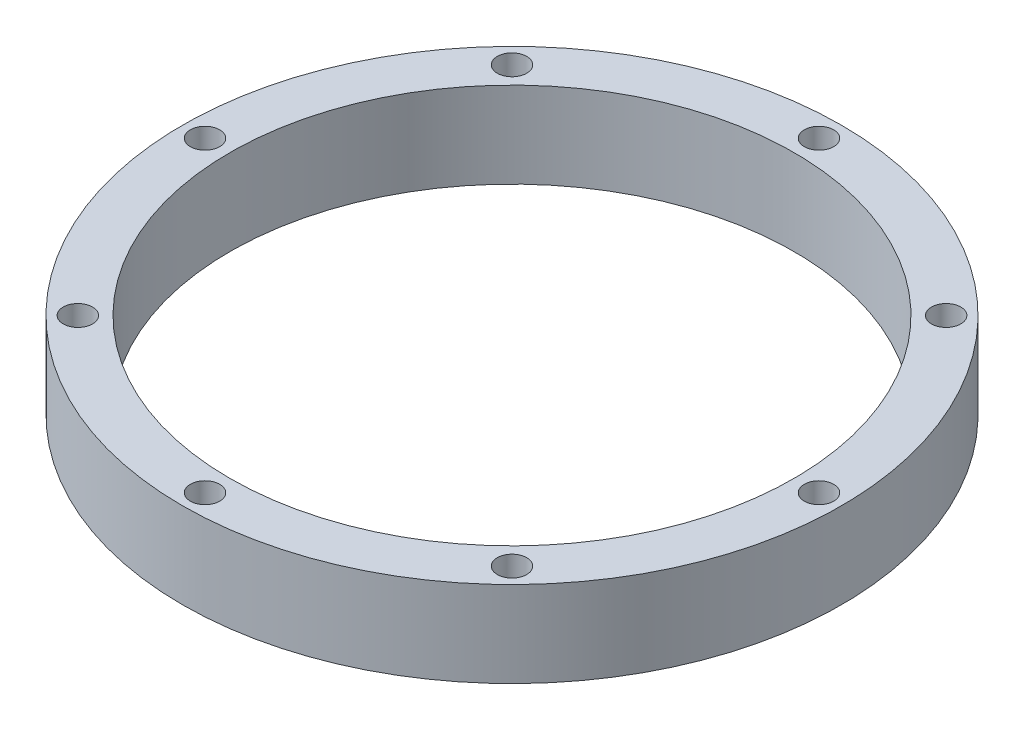
ISO-10303-21;
HEADER;
FILE_DESCRIPTION(('STEP AP214'),'2;1');
FILE_NAME('part.step','',(''),(''),'','','');
FILE_SCHEMA(('AUTOMOTIVE_DESIGN { 1 0 10303 214 1 1 1 1 }'));
ENDSEC;
DATA;
#1=APPLICATION_CONTEXT('core data for automotive mechanical design processes');
#2=APPLICATION_PROTOCOL_DEFINITION('international standard','automotive_design',2000,#1);
#3=PRODUCT_CONTEXT('',#1,'mechanical');
#4=PRODUCT('Part','Part','',(#3));
#5=PRODUCT_RELATED_PRODUCT_CATEGORY('part','',(#4));
#6=PRODUCT_DEFINITION_FORMATION('','',#4);
#7=PRODUCT_DEFINITION_CONTEXT('part definition',#1,'design');
#8=PRODUCT_DEFINITION('design','',#6,#7);
#9=PRODUCT_DEFINITION_SHAPE('','',#8);
#10=(LENGTH_UNIT() NAMED_UNIT(*) SI_UNIT(.MILLI.,.METRE.));
#11=(NAMED_UNIT(*) PLANE_ANGLE_UNIT() SI_UNIT($,.RADIAN.));
#12=(NAMED_UNIT(*) SI_UNIT($,.STERADIAN.) SOLID_ANGLE_UNIT());
#13=UNCERTAINTY_MEASURE_WITH_UNIT(LENGTH_MEASURE(1.E-05),#10,'distance_accuracy_value','');
#14=(GEOMETRIC_REPRESENTATION_CONTEXT(3) GLOBAL_UNCERTAINTY_ASSIGNED_CONTEXT((#13)) GLOBAL_UNIT_ASSIGNED_CONTEXT((#10,
#11,#12)) REPRESENTATION_CONTEXT('',''));
#15=CARTESIAN_POINT('',(0.,0.,0.));
#16=DIRECTION('',(0.,0.,1.));
#17=DIRECTION('',(1.,0.,0.));
#18=AXIS2_PLACEMENT_3D('',#15,#16,#17);
#19=CARTESIAN_POINT('',(0.,19.,0.));
#20=DIRECTION('',(0.,1.,0.));
#21=DIRECTION('',(0.,0.,1.));
#22=AXIS2_PLACEMENT_3D('',#19,#20,#21);
#23=PLANE('',#22);
#24=CARTESIAN_POINT('',(0.,19.,68.));
#25=DIRECTION('',(0.,1.,0.));
#26=DIRECTION('',(0.,0.,1.));
#27=AXIS2_PLACEMENT_3D('',#24,#25,#26);
#28=CIRCLE('',#27,3.25);
#29=CARTESIAN_POINT('',(0.,19.,71.25));
#30=VERTEX_POINT('',#29);
#31=EDGE_CURVE('E83',#30,#30,#28,.T.);
#32=ORIENTED_EDGE('',*,*,#31,.F.);
#33=EDGE_LOOP('',(#32));
#34=FACE_BOUND('',#33,.T.);
#35=CARTESIAN_POINT('',(68.,19.,0.));
#36=DIRECTION('',(0.,1.,0.));
#37=DIRECTION('',(0.,0.,1.));
#38=AXIS2_PLACEMENT_3D('',#35,#36,#37);
#39=CIRCLE('',#38,3.25000000000001);
#40=CARTESIAN_POINT('',(68.,19.,3.25));
#41=VERTEX_POINT('',#40);
#42=EDGE_CURVE('E71',#41,#41,#39,.T.);
#43=ORIENTED_EDGE('',*,*,#42,.F.);
#44=EDGE_LOOP('',(#43));
#45=FACE_BOUND('',#44,.T.);
#46=CARTESIAN_POINT('',(0.,19.,-68.));
#47=DIRECTION('',(0.,1.,0.));
#48=DIRECTION('',(0.,0.,1.));
#49=AXIS2_PLACEMENT_3D('',#46,#47,#48);
#50=CIRCLE('',#49,3.25);
#51=CARTESIAN_POINT('',(0.,19.,-64.75));
#52=VERTEX_POINT('',#51);
#53=EDGE_CURVE('E59',#52,#52,#50,.T.);
#54=ORIENTED_EDGE('',*,*,#53,.F.);
#55=EDGE_LOOP('',(#54));
#56=FACE_BOUND('',#55,.T.);
#57=CARTESIAN_POINT('',(-68.,19.,0.));
#58=DIRECTION('',(0.,1.,0.));
#59=DIRECTION('',(0.,0.,1.));
#60=AXIS2_PLACEMENT_3D('',#57,#58,#59);
#61=CIRCLE('',#60,3.25000000000001);
#62=CARTESIAN_POINT('',(-68.,19.,3.25000000000001));
#63=VERTEX_POINT('',#62);
#64=EDGE_CURVE('E47',#63,#63,#61,.T.);
#65=ORIENTED_EDGE('',*,*,#64,.F.);
#66=EDGE_LOOP('',(#65));
#67=FACE_BOUND('',#66,.T.);
#68=CARTESIAN_POINT('',(0.,19.,0.));
#69=DIRECTION('',(0.,1.,0.));
#70=DIRECTION('',(0.,0.,1.));
#71=AXIS2_PLACEMENT_3D('',#68,#69,#70);
#72=CIRCLE('',#71,73.);
#73=CARTESIAN_POINT('',(0.,19.,73.));
#74=VERTEX_POINT('',#73);
#75=EDGE_CURVE('E10',#74,#74,#72,.T.);
#76=ORIENTED_EDGE('',*,*,#75,.T.);
#77=EDGE_LOOP('',(#76));
#78=FACE_BOUND('',#77,.T.);
#79=CARTESIAN_POINT('',(0.,19.,0.));
#80=DIRECTION('',(0.,1.,0.));
#81=DIRECTION('',(0.,0.,1.));
#82=AXIS2_PLACEMENT_3D('',#79,#80,#81);
#83=CIRCLE('',#82,62.5);
#84=CARTESIAN_POINT('',(0.,19.,62.5));
#85=VERTEX_POINT('',#84);
#86=EDGE_CURVE('E42',#85,#85,#83,.T.);
#87=ORIENTED_EDGE('',*,*,#86,.F.);
#88=EDGE_LOOP('',(#87));
#89=FACE_BOUND('',#88,.T.);
#90=CARTESIAN_POINT('',(-48.0832611206852,19.,-48.0832611206852));
#91=DIRECTION('',(0.,1.,0.));
#92=DIRECTION('',(0.,0.,1.));
#93=AXIS2_PLACEMENT_3D('',#90,#91,#92);
#94=CIRCLE('',#93,3.25);
#95=CARTESIAN_POINT('',(-48.0832611206852,19.,-44.8332611206852));
#96=VERTEX_POINT('',#95);
#97=EDGE_CURVE('E53',#96,#96,#94,.T.);
#98=ORIENTED_EDGE('',*,*,#97,.F.);
#99=EDGE_LOOP('',(#98));
#100=FACE_BOUND('',#99,.T.);
#101=CARTESIAN_POINT('',(48.0832611206852,19.,-48.0832611206852));
#102=DIRECTION('',(0.,1.,0.));
#103=DIRECTION('',(0.,0.,1.));
#104=AXIS2_PLACEMENT_3D('',#101,#102,#103);
#105=CIRCLE('',#104,3.25);
#106=CARTESIAN_POINT('',(48.0832611206852,19.,-44.8332611206852));
#107=VERTEX_POINT('',#106);
#108=EDGE_CURVE('E65',#107,#107,#105,.T.);
#109=ORIENTED_EDGE('',*,*,#108,.F.);
#110=EDGE_LOOP('',(#109));
#111=FACE_BOUND('',#110,.T.);
#112=CARTESIAN_POINT('',(48.0832611206853,19.,48.0832611206852));
#113=DIRECTION('',(0.,1.,0.));
#114=DIRECTION('',(0.,0.,1.));
#115=AXIS2_PLACEMENT_3D('',#112,#113,#114);
#116=CIRCLE('',#115,3.25);
#117=CARTESIAN_POINT('',(48.0832611206853,19.,51.3332611206852));
#118=VERTEX_POINT('',#117);
#119=EDGE_CURVE('E77',#118,#118,#116,.T.);
#120=ORIENTED_EDGE('',*,*,#119,.F.);
#121=EDGE_LOOP('',(#120));
#122=FACE_BOUND('',#121,.T.);
#123=CARTESIAN_POINT('',(-48.0832611206852,19.,48.0832611206853));
#124=DIRECTION('',(0.,1.,0.));
#125=DIRECTION('',(0.,0.,1.));
#126=AXIS2_PLACEMENT_3D('',#123,#124,#125);
#127=CIRCLE('',#126,3.25);
#128=CARTESIAN_POINT('',(-48.0832611206852,19.,51.3332611206853));
#129=VERTEX_POINT('',#128);
#130=EDGE_CURVE('E89',#129,#129,#127,.T.);
#131=ORIENTED_EDGE('',*,*,#130,.F.);
#132=EDGE_LOOP('',(#131));
#133=FACE_BOUND('',#132,.T.);
#134=ADVANCED_FACE('F31',(#34,#45,#56,#67,#78,#89,#100,#111,#122,#133),#23,.T.);
#135=CARTESIAN_POINT('',(0.,0.,0.));
#136=DIRECTION('',(0.,1.,0.));
#137=DIRECTION('',(0.,0.,1.));
#138=AXIS2_PLACEMENT_3D('',#135,#136,#137);
#139=PLANE('',#138);
#140=CARTESIAN_POINT('',(0.,0.,68.));
#141=DIRECTION('',(0.,1.,0.));
#142=DIRECTION('',(0.,0.,1.));
#143=AXIS2_PLACEMENT_3D('',#140,#141,#142);
#144=CIRCLE('',#143,3.25);
#145=CARTESIAN_POINT('',(0.,0.,71.25));
#146=VERTEX_POINT('',#145);
#147=EDGE_CURVE('E86',#146,#146,#144,.T.);
#148=ORIENTED_EDGE('',*,*,#147,.T.);
#149=EDGE_LOOP('',(#148));
#150=FACE_BOUND('',#149,.T.);
#151=CARTESIAN_POINT('',(68.,0.,0.));
#152=DIRECTION('',(0.,1.,0.));
#153=DIRECTION('',(0.,0.,1.));
#154=AXIS2_PLACEMENT_3D('',#151,#152,#153);
#155=CIRCLE('',#154,3.25000000000001);
#156=CARTESIAN_POINT('',(68.,0.,3.25));
#157=VERTEX_POINT('',#156);
#158=EDGE_CURVE('E74',#157,#157,#155,.T.);
#159=ORIENTED_EDGE('',*,*,#158,.T.);
#160=EDGE_LOOP('',(#159));
#161=FACE_BOUND('',#160,.T.);
#162=CARTESIAN_POINT('',(0.,0.,-68.));
#163=DIRECTION('',(0.,1.,0.));
#164=DIRECTION('',(0.,0.,1.));
#165=AXIS2_PLACEMENT_3D('',#162,#163,#164);
#166=CIRCLE('',#165,3.25);
#167=CARTESIAN_POINT('',(0.,0.,-64.75));
#168=VERTEX_POINT('',#167);
#169=EDGE_CURVE('E62',#168,#168,#166,.T.);
#170=ORIENTED_EDGE('',*,*,#169,.T.);
#171=EDGE_LOOP('',(#170));
#172=FACE_BOUND('',#171,.T.);
#173=CARTESIAN_POINT('',(-68.,0.,0.));
#174=DIRECTION('',(0.,1.,0.));
#175=DIRECTION('',(0.,0.,1.));
#176=AXIS2_PLACEMENT_3D('',#173,#174,#175);
#177=CIRCLE('',#176,3.25000000000001);
#178=CARTESIAN_POINT('',(-68.,0.,3.25000000000001));
#179=VERTEX_POINT('',#178);
#180=EDGE_CURVE('E50',#179,#179,#177,.T.);
#181=ORIENTED_EDGE('',*,*,#180,.T.);
#182=EDGE_LOOP('',(#181));
#183=FACE_BOUND('',#182,.T.);
#184=CARTESIAN_POINT('',(0.,0.,0.));
#185=DIRECTION('',(0.,1.,0.));
#186=DIRECTION('',(0.,0.,1.));
#187=AXIS2_PLACEMENT_3D('',#184,#185,#186);
#188=CIRCLE('',#187,73.);
#189=CARTESIAN_POINT('',(0.,0.,73.));
#190=VERTEX_POINT('',#189);
#191=EDGE_CURVE('E35',#190,#190,#188,.T.);
#192=ORIENTED_EDGE('',*,*,#191,.F.);
#193=EDGE_LOOP('',(#192));
#194=FACE_BOUND('',#193,.T.);
#195=CARTESIAN_POINT('',(0.,0.,0.));
#196=DIRECTION('',(0.,1.,0.));
#197=DIRECTION('',(0.,0.,1.));
#198=AXIS2_PLACEMENT_3D('',#195,#196,#197);
#199=CIRCLE('',#198,62.5);
#200=CARTESIAN_POINT('',(0.,0.,62.5));
#201=VERTEX_POINT('',#200);
#202=EDGE_CURVE('E44',#201,#201,#199,.T.);
#203=ORIENTED_EDGE('',*,*,#202,.T.);
#204=EDGE_LOOP('',(#203));
#205=FACE_BOUND('',#204,.T.);
#206=CARTESIAN_POINT('',(-48.0832611206852,0.,-48.0832611206852));
#207=DIRECTION('',(0.,1.,0.));
#208=DIRECTION('',(0.,0.,1.));
#209=AXIS2_PLACEMENT_3D('',#206,#207,#208);
#210=CIRCLE('',#209,3.25);
#211=CARTESIAN_POINT('',(-48.0832611206852,0.,-44.8332611206852));
#212=VERTEX_POINT('',#211);
#213=EDGE_CURVE('E56',#212,#212,#210,.T.);
#214=ORIENTED_EDGE('',*,*,#213,.T.);
#215=EDGE_LOOP('',(#214));
#216=FACE_BOUND('',#215,.T.);
#217=CARTESIAN_POINT('',(48.0832611206852,0.,-48.0832611206852));
#218=DIRECTION('',(0.,1.,0.));
#219=DIRECTION('',(0.,0.,1.));
#220=AXIS2_PLACEMENT_3D('',#217,#218,#219);
#221=CIRCLE('',#220,3.25);
#222=CARTESIAN_POINT('',(48.0832611206852,0.,-44.8332611206852));
#223=VERTEX_POINT('',#222);
#224=EDGE_CURVE('E68',#223,#223,#221,.T.);
#225=ORIENTED_EDGE('',*,*,#224,.T.);
#226=EDGE_LOOP('',(#225));
#227=FACE_BOUND('',#226,.T.);
#228=CARTESIAN_POINT('',(48.0832611206853,0.,48.0832611206852));
#229=DIRECTION('',(0.,1.,0.));
#230=DIRECTION('',(0.,0.,1.));
#231=AXIS2_PLACEMENT_3D('',#228,#229,#230);
#232=CIRCLE('',#231,3.25);
#233=CARTESIAN_POINT('',(48.0832611206853,0.,51.3332611206852));
#234=VERTEX_POINT('',#233);
#235=EDGE_CURVE('E80',#234,#234,#232,.T.);
#236=ORIENTED_EDGE('',*,*,#235,.T.);
#237=EDGE_LOOP('',(#236));
#238=FACE_BOUND('',#237,.T.);
#239=CARTESIAN_POINT('',(-48.0832611206852,0.,48.0832611206853));
#240=DIRECTION('',(0.,1.,0.));
#241=DIRECTION('',(0.,0.,1.));
#242=AXIS2_PLACEMENT_3D('',#239,#240,#241);
#243=CIRCLE('',#242,3.25);
#244=CARTESIAN_POINT('',(-48.0832611206852,0.,51.3332611206853));
#245=VERTEX_POINT('',#244);
#246=EDGE_CURVE('E92',#245,#245,#243,.T.);
#247=ORIENTED_EDGE('',*,*,#246,.T.);
#248=EDGE_LOOP('',(#247));
#249=FACE_BOUND('',#248,.T.);
#250=ADVANCED_FACE('F102',(#150,#161,#172,#183,#194,#205,#216,#227,#238,#249),#139,.F.);
#251=CARTESIAN_POINT('',(0.,19.,0.));
#252=DIRECTION('',(0.,-1.,0.));
#253=DIRECTION('',(0.,0.,-1.));
#254=AXIS2_PLACEMENT_3D('',#251,#252,#253);
#255=CYLINDRICAL_SURFACE('',#254,73.);
#256=ORIENTED_EDGE('',*,*,#75,.F.);
#257=EDGE_LOOP('',(#256));
#258=FACE_BOUND('',#257,.T.);
#259=ORIENTED_EDGE('',*,*,#191,.T.);
#260=EDGE_LOOP('',(#259));
#261=FACE_BOUND('',#260,.T.);
#262=ADVANCED_FACE('F33',(#258,#261),#255,.T.);
#263=CARTESIAN_POINT('',(0.,19.,0.));
#264=DIRECTION('',(0.,-1.,0.));
#265=DIRECTION('',(0.,0.,-1.));
#266=AXIS2_PLACEMENT_3D('',#263,#264,#265);
#267=CYLINDRICAL_SURFACE('',#266,62.5);
#268=ORIENTED_EDGE('',*,*,#86,.T.);
#269=EDGE_LOOP('',(#268));
#270=FACE_BOUND('',#269,.T.);
#271=ORIENTED_EDGE('',*,*,#202,.F.);
#272=EDGE_LOOP('',(#271));
#273=FACE_BOUND('',#272,.T.);
#274=ADVANCED_FACE('F112',(#270,#273),#267,.F.);
#275=CARTESIAN_POINT('',(-68.,19.,0.));
#276=DIRECTION('',(0.,-1.,0.));
#277=DIRECTION('',(0.,0.,-1.));
#278=AXIS2_PLACEMENT_3D('',#275,#276,#277);
#279=CYLINDRICAL_SURFACE('',#278,3.25000000000001);
#280=ORIENTED_EDGE('',*,*,#64,.T.);
#281=EDGE_LOOP('',(#280));
#282=FACE_BOUND('',#281,.T.);
#283=ORIENTED_EDGE('',*,*,#180,.F.);
#284=EDGE_LOOP('',(#283));
#285=FACE_BOUND('',#284,.T.);
#286=ADVANCED_FACE('F115',(#282,#285),#279,.F.);
#287=CARTESIAN_POINT('',(-48.0832611206852,19.,-48.0832611206852));
#288=DIRECTION('',(0.,-1.,0.));
#289=DIRECTION('',(0.,0.,-1.));
#290=AXIS2_PLACEMENT_3D('',#287,#288,#289);
#291=CYLINDRICAL_SURFACE('',#290,3.25);
#292=ORIENTED_EDGE('',*,*,#97,.T.);
#293=EDGE_LOOP('',(#292));
#294=FACE_BOUND('',#293,.T.);
#295=ORIENTED_EDGE('',*,*,#213,.F.);
#296=EDGE_LOOP('',(#295));
#297=FACE_BOUND('',#296,.T.);
#298=ADVANCED_FACE('F119',(#294,#297),#291,.F.);
#299=CARTESIAN_POINT('',(0.,19.,-68.));
#300=DIRECTION('',(0.,-1.,0.));
#301=DIRECTION('',(0.,0.,-1.));
#302=AXIS2_PLACEMENT_3D('',#299,#300,#301);
#303=CYLINDRICAL_SURFACE('',#302,3.25);
#304=ORIENTED_EDGE('',*,*,#53,.T.);
#305=EDGE_LOOP('',(#304));
#306=FACE_BOUND('',#305,.T.);
#307=ORIENTED_EDGE('',*,*,#169,.F.);
#308=EDGE_LOOP('',(#307));
#309=FACE_BOUND('',#308,.T.);
#310=ADVANCED_FACE('F123',(#306,#309),#303,.F.);
#311=CARTESIAN_POINT('',(48.0832611206852,19.,-48.0832611206852));
#312=DIRECTION('',(0.,-1.,0.));
#313=DIRECTION('',(0.,0.,-1.));
#314=AXIS2_PLACEMENT_3D('',#311,#312,#313);
#315=CYLINDRICAL_SURFACE('',#314,3.25);
#316=ORIENTED_EDGE('',*,*,#108,.T.);
#317=EDGE_LOOP('',(#316));
#318=FACE_BOUND('',#317,.T.);
#319=ORIENTED_EDGE('',*,*,#224,.F.);
#320=EDGE_LOOP('',(#319));
#321=FACE_BOUND('',#320,.T.);
#322=ADVANCED_FACE('F127',(#318,#321),#315,.F.);
#323=CARTESIAN_POINT('',(68.,19.,0.));
#324=DIRECTION('',(0.,-1.,0.));
#325=DIRECTION('',(0.,0.,-1.));
#326=AXIS2_PLACEMENT_3D('',#323,#324,#325);
#327=CYLINDRICAL_SURFACE('',#326,3.25000000000001);
#328=ORIENTED_EDGE('',*,*,#42,.T.);
#329=EDGE_LOOP('',(#328));
#330=FACE_BOUND('',#329,.T.);
#331=ORIENTED_EDGE('',*,*,#158,.F.);
#332=EDGE_LOOP('',(#331));
#333=FACE_BOUND('',#332,.T.);
#334=ADVANCED_FACE('F131',(#330,#333),#327,.F.);
#335=CARTESIAN_POINT('',(48.0832611206853,19.,48.0832611206852));
#336=DIRECTION('',(0.,-1.,0.));
#337=DIRECTION('',(0.,0.,-1.));
#338=AXIS2_PLACEMENT_3D('',#335,#336,#337);
#339=CYLINDRICAL_SURFACE('',#338,3.25);
#340=ORIENTED_EDGE('',*,*,#119,.T.);
#341=EDGE_LOOP('',(#340));
#342=FACE_BOUND('',#341,.T.);
#343=ORIENTED_EDGE('',*,*,#235,.F.);
#344=EDGE_LOOP('',(#343));
#345=FACE_BOUND('',#344,.T.);
#346=ADVANCED_FACE('F135',(#342,#345),#339,.F.);
#347=CARTESIAN_POINT('',(0.,19.,68.));
#348=DIRECTION('',(0.,-1.,0.));
#349=DIRECTION('',(0.,0.,-1.));
#350=AXIS2_PLACEMENT_3D('',#347,#348,#349);
#351=CYLINDRICAL_SURFACE('',#350,3.25);
#352=ORIENTED_EDGE('',*,*,#31,.T.);
#353=EDGE_LOOP('',(#352));
#354=FACE_BOUND('',#353,.T.);
#355=ORIENTED_EDGE('',*,*,#147,.F.);
#356=EDGE_LOOP('',(#355));
#357=FACE_BOUND('',#356,.T.);
#358=ADVANCED_FACE('F139',(#354,#357),#351,.F.);
#359=CARTESIAN_POINT('',(-48.0832611206852,19.,48.0832611206853));
#360=DIRECTION('',(0.,-1.,0.));
#361=DIRECTION('',(0.,0.,-1.));
#362=AXIS2_PLACEMENT_3D('',#359,#360,#361);
#363=CYLINDRICAL_SURFACE('',#362,3.25);
#364=ORIENTED_EDGE('',*,*,#130,.T.);
#365=EDGE_LOOP('',(#364));
#366=FACE_BOUND('',#365,.T.);
#367=ORIENTED_EDGE('',*,*,#246,.F.);
#368=EDGE_LOOP('',(#367));
#369=FACE_BOUND('',#368,.T.);
#370=ADVANCED_FACE('F98',(#366,#369),#363,.F.);
#371=CLOSED_SHELL('',(#134,#250,#262,#274,#286,#298,#310,#322,#334,#346,#358,#370));
#372=MANIFOLD_SOLID_BREP('B2',#371);
#373=ADVANCED_BREP_SHAPE_REPRESENTATION('',(#18,#372),#14);
#374=SHAPE_DEFINITION_REPRESENTATION(#9,#373);
ENDSEC;
END-ISO-10303-21;
